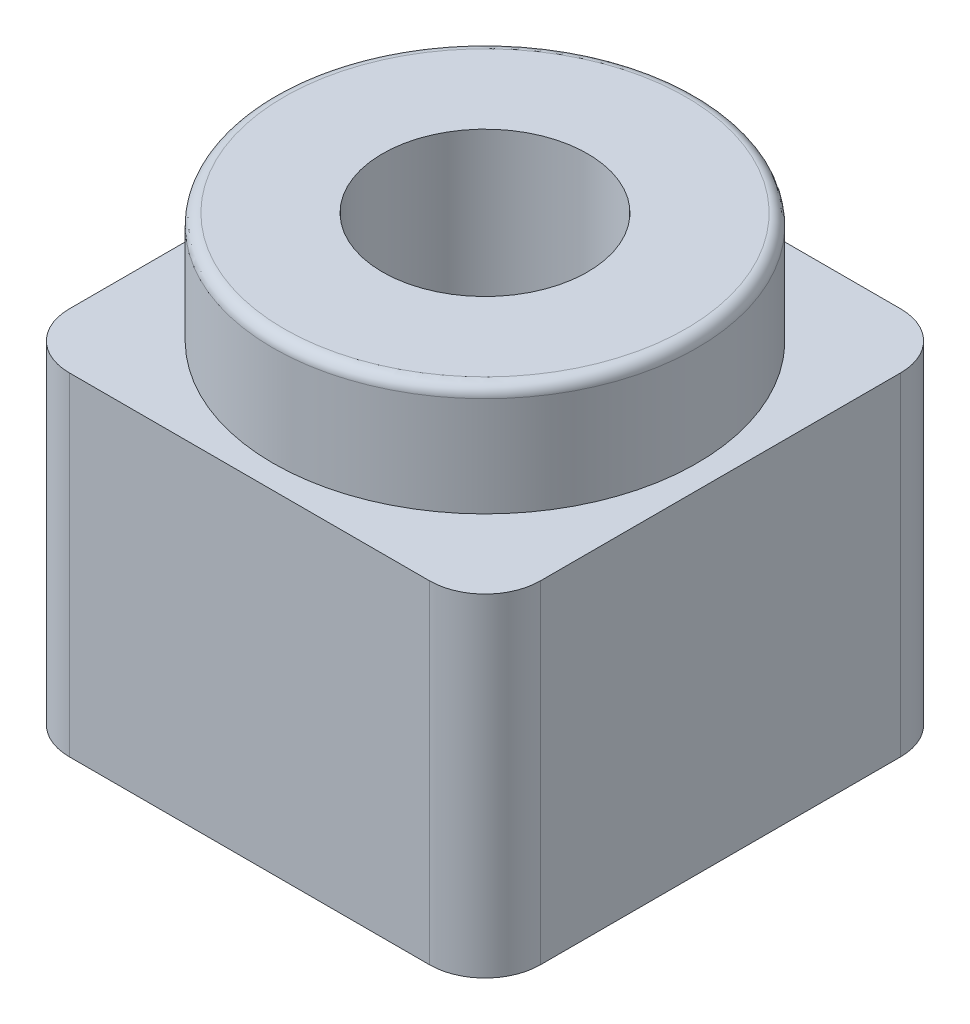
ISO-10303-21;
HEADER;
FILE_DESCRIPTION(('STEP AP214'),'2;1');
FILE_NAME('part.step','',(''),(''),'','','');
FILE_SCHEMA(('AUTOMOTIVE_DESIGN { 1 0 10303 214 1 1 1 1 }'));
ENDSEC;
DATA;
#1=APPLICATION_CONTEXT('core data for automotive mechanical design processes');
#2=APPLICATION_PROTOCOL_DEFINITION('international standard','automotive_design',2000,#1);
#3=PRODUCT_CONTEXT('',#1,'mechanical');
#4=PRODUCT('Part','Part','',(#3));
#5=PRODUCT_RELATED_PRODUCT_CATEGORY('part','',(#4));
#6=PRODUCT_DEFINITION_FORMATION('','',#4);
#7=PRODUCT_DEFINITION_CONTEXT('part definition',#1,'design');
#8=PRODUCT_DEFINITION('design','',#6,#7);
#9=PRODUCT_DEFINITION_SHAPE('','',#8);
#10=(LENGTH_UNIT() NAMED_UNIT(*) SI_UNIT(.MILLI.,.METRE.));
#11=(NAMED_UNIT(*) PLANE_ANGLE_UNIT() SI_UNIT($,.RADIAN.));
#12=(NAMED_UNIT(*) SI_UNIT($,.STERADIAN.) SOLID_ANGLE_UNIT());
#13=UNCERTAINTY_MEASURE_WITH_UNIT(LENGTH_MEASURE(1.E-05),#10,'distance_accuracy_value','');
#14=(GEOMETRIC_REPRESENTATION_CONTEXT(3) GLOBAL_UNCERTAINTY_ASSIGNED_CONTEXT((#13)) GLOBAL_UNIT_ASSIGNED_CONTEXT((#10,
#11,#12)) REPRESENTATION_CONTEXT('',''));
#15=CARTESIAN_POINT('',(0.,0.,0.));
#16=DIRECTION('',(0.,0.,1.));
#17=DIRECTION('',(1.,0.,0.));
#18=AXIS2_PLACEMENT_3D('',#15,#16,#17);
#19=CARTESIAN_POINT('',(0.,6.,0.));
#20=DIRECTION('',(0.,1.,0.));
#21=DIRECTION('',(0.,0.,1.));
#22=AXIS2_PLACEMENT_3D('',#19,#20,#21);
#23=PLANE('',#22);
#24=DIRECTION('',(-1.,0.,0.));
#25=VECTOR('',#24,1.);
#26=CARTESIAN_POINT('',(4.25,6.,-4.25));
#27=LINE('',#26,#25);
#28=CARTESIAN_POINT('',(3.25,6.,-4.25));
#29=VERTEX_POINT('',#28);
#30=CARTESIAN_POINT('',(-3.25,6.,-4.25));
#31=VERTEX_POINT('',#30);
#32=EDGE_CURVE('E112',#29,#31,#27,.T.);
#33=ORIENTED_EDGE('',*,*,#32,.T.);
#34=CARTESIAN_POINT('',(-3.25,6.,-3.25));
#35=DIRECTION('',(0.,1.,0.));
#36=DIRECTION('',(0.,0.,1.));
#37=AXIS2_PLACEMENT_3D('',#34,#35,#36);
#38=CIRCLE('',#37,1.);
#39=CARTESIAN_POINT('',(-4.25,6.,-3.25));
#40=VERTEX_POINT('',#39);
#41=EDGE_CURVE('E157',#31,#40,#38,.T.);
#42=ORIENTED_EDGE('',*,*,#41,.T.);
#43=DIRECTION('',(0.,0.,1.));
#44=VECTOR('',#43,1.);
#45=CARTESIAN_POINT('',(-4.25,6.,-4.25));
#46=LINE('',#45,#44);
#47=CARTESIAN_POINT('',(-4.25,6.,3.25));
#48=VERTEX_POINT('',#47);
#49=EDGE_CURVE('E219',#40,#48,#46,.T.);
#50=ORIENTED_EDGE('',*,*,#49,.T.);
#51=CARTESIAN_POINT('',(-3.25,6.,3.25));
#52=DIRECTION('',(0.,1.,0.));
#53=DIRECTION('',(0.,0.,1.));
#54=AXIS2_PLACEMENT_3D('',#51,#52,#53);
#55=CIRCLE('',#54,1.);
#56=CARTESIAN_POINT('',(-3.25,6.,4.25));
#57=VERTEX_POINT('',#56);
#58=EDGE_CURVE('E140',#48,#57,#55,.T.);
#59=ORIENTED_EDGE('',*,*,#58,.T.);
#60=DIRECTION('',(-1.,0.,0.));
#61=VECTOR('',#60,1.);
#62=CARTESIAN_POINT('',(4.25,6.,4.25));
#63=LINE('',#62,#61);
#64=CARTESIAN_POINT('',(3.25,6.,4.25));
#65=VERTEX_POINT('',#64);
#66=EDGE_CURVE('E218',#65,#57,#63,.T.);
#67=ORIENTED_EDGE('',*,*,#66,.F.);
#68=CARTESIAN_POINT('',(3.25,6.,3.25));
#69=DIRECTION('',(0.,1.,0.));
#70=DIRECTION('',(0.,0.,1.));
#71=AXIS2_PLACEMENT_3D('',#68,#69,#70);
#72=CIRCLE('',#71,1.);
#73=CARTESIAN_POINT('',(4.25,6.,3.25));
#74=VERTEX_POINT('',#73);
#75=EDGE_CURVE('E138',#65,#74,#72,.T.);
#76=ORIENTED_EDGE('',*,*,#75,.T.);
#77=DIRECTION('',(0.,0.,1.));
#78=VECTOR('',#77,1.);
#79=CARTESIAN_POINT('',(4.25,6.,-4.25));
#80=LINE('',#79,#78);
#81=CARTESIAN_POINT('',(4.25,6.,-3.25));
#82=VERTEX_POINT('',#81);
#83=EDGE_CURVE('E114',#82,#74,#80,.T.);
#84=ORIENTED_EDGE('',*,*,#83,.F.);
#85=CARTESIAN_POINT('',(3.25,6.,-3.25));
#86=DIRECTION('',(0.,1.,0.));
#87=DIRECTION('',(0.,0.,1.));
#88=AXIS2_PLACEMENT_3D('',#85,#86,#87);
#89=CIRCLE('',#88,1.);
#90=EDGE_CURVE('E142',#82,#29,#89,.T.);
#91=ORIENTED_EDGE('',*,*,#90,.T.);
#92=EDGE_LOOP('',(#33,#42,#50,#59,#67,#76,#84,#91));
#93=FACE_BOUND('',#92,.T.);
#94=CARTESIAN_POINT('',(0.,6.,0.));
#95=DIRECTION('',(0.,1.,0.));
#96=DIRECTION('',(0.,0.,1.));
#97=AXIS2_PLACEMENT_3D('',#94,#95,#96);
#98=CIRCLE('',#97,3.825);
#99=CARTESIAN_POINT('',(0.,6.,3.825));
#100=VERTEX_POINT('',#99);
#101=EDGE_CURVE('E118',#100,#100,#98,.T.);
#102=ORIENTED_EDGE('',*,*,#101,.F.);
#103=EDGE_LOOP('',(#102));
#104=FACE_BOUND('',#103,.T.);
#105=ADVANCED_FACE('F32',(#93,#104),#23,.T.);
#106=CARTESIAN_POINT('',(4.25,6.,-4.25));
#107=DIRECTION('',(0.,0.,1.));
#108=DIRECTION('',(1.,0.,0.));
#109=AXIS2_PLACEMENT_3D('',#106,#107,#108);
#110=PLANE('',#109);
#111=DIRECTION('',(-1.,0.,0.));
#112=VECTOR('',#111,1.);
#113=CARTESIAN_POINT('',(4.25,0.,-4.25));
#114=LINE('',#113,#112);
#115=CARTESIAN_POINT('',(3.25,0.,-4.25));
#116=VERTEX_POINT('',#115);
#117=CARTESIAN_POINT('',(-3.25,0.,-4.25));
#118=VERTEX_POINT('',#117);
#119=EDGE_CURVE('E111',#116,#118,#114,.T.);
#120=ORIENTED_EDGE('',*,*,#119,.T.);
#121=DIRECTION('',(0.,-1.,0.));
#122=VECTOR('',#121,1.);
#123=CARTESIAN_POINT('',(-3.25,6.,-4.25));
#124=LINE('',#123,#122);
#125=EDGE_CURVE('E47',#118,#31,#124,.F.);
#126=ORIENTED_EDGE('',*,*,#125,.T.);
#127=ORIENTED_EDGE('',*,*,#32,.F.);
#128=DIRECTION('',(0.,-1.,0.));
#129=VECTOR('',#128,1.);
#130=CARTESIAN_POINT('',(3.25,0.,-4.25));
#131=LINE('',#130,#129);
#132=EDGE_CURVE('E103',#29,#116,#131,.T.);
#133=ORIENTED_EDGE('',*,*,#132,.T.);
#134=EDGE_LOOP('',(#120,#126,#127,#133));
#135=FACE_BOUND('',#134,.T.);
#136=ADVANCED_FACE('F110',(#135),#110,.F.);
#137=CARTESIAN_POINT('',(-4.25,6.,-4.25));
#138=DIRECTION('',(1.,0.,0.));
#139=DIRECTION('',(0.,0.,-1.));
#140=AXIS2_PLACEMENT_3D('',#137,#138,#139);
#141=PLANE('',#140);
#142=ORIENTED_EDGE('',*,*,#49,.F.);
#143=DIRECTION('',(0.,-1.,0.));
#144=VECTOR('',#143,1.);
#145=CARTESIAN_POINT('',(-4.25,6.,-3.25));
#146=LINE('',#145,#144);
#147=CARTESIAN_POINT('',(-4.25,0.,-3.25));
#148=VERTEX_POINT('',#147);
#149=EDGE_CURVE('E152',#40,#148,#146,.T.);
#150=ORIENTED_EDGE('',*,*,#149,.T.);
#151=DIRECTION('',(0.,0.,1.));
#152=VECTOR('',#151,1.);
#153=CARTESIAN_POINT('',(-4.25,0.,-4.25));
#154=LINE('',#153,#152);
#155=CARTESIAN_POINT('',(-4.25,0.,3.25));
#156=VERTEX_POINT('',#155);
#157=EDGE_CURVE('E117',#148,#156,#154,.T.);
#158=ORIENTED_EDGE('',*,*,#157,.T.);
#159=DIRECTION('',(0.,-1.,0.));
#160=VECTOR('',#159,1.);
#161=CARTESIAN_POINT('',(-4.25,6.,3.25));
#162=LINE('',#161,#160);
#163=EDGE_CURVE('E149',#156,#48,#162,.F.);
#164=ORIENTED_EDGE('',*,*,#163,.T.);
#165=EDGE_LOOP('',(#142,#150,#158,#164));
#166=FACE_BOUND('',#165,.T.);
#167=ADVANCED_FACE('F179',(#166),#141,.F.);
#168=CARTESIAN_POINT('',(4.25,6.,4.25));
#169=DIRECTION('',(0.,0.,1.));
#170=DIRECTION('',(1.,0.,0.));
#171=AXIS2_PLACEMENT_3D('',#168,#169,#170);
#172=PLANE('',#171);
#173=ORIENTED_EDGE('',*,*,#66,.T.);
#174=DIRECTION('',(0.,-1.,0.));
#175=VECTOR('',#174,1.);
#176=CARTESIAN_POINT('',(-3.25,0.,4.25));
#177=LINE('',#176,#175);
#178=CARTESIAN_POINT('',(-3.25,0.,4.25));
#179=VERTEX_POINT('',#178);
#180=EDGE_CURVE('E146',#57,#179,#177,.T.);
#181=ORIENTED_EDGE('',*,*,#180,.T.);
#182=DIRECTION('',(-1.,0.,0.));
#183=VECTOR('',#182,1.);
#184=CARTESIAN_POINT('',(4.25,0.,4.25));
#185=LINE('',#184,#183);
#186=CARTESIAN_POINT('',(3.25,0.,4.25));
#187=VERTEX_POINT('',#186);
#188=EDGE_CURVE('E120',#187,#179,#185,.T.);
#189=ORIENTED_EDGE('',*,*,#188,.F.);
#190=DIRECTION('',(0.,-1.,0.));
#191=VECTOR('',#190,1.);
#192=CARTESIAN_POINT('',(3.25,6.,4.25));
#193=LINE('',#192,#191);
#194=EDGE_CURVE('E144',#187,#65,#193,.F.);
#195=ORIENTED_EDGE('',*,*,#194,.T.);
#196=EDGE_LOOP('',(#173,#181,#189,#195));
#197=FACE_BOUND('',#196,.T.);
#198=ADVANCED_FACE('F192',(#197),#172,.T.);
#199=CARTESIAN_POINT('',(4.25,6.,-4.25));
#200=DIRECTION('',(1.,0.,0.));
#201=DIRECTION('',(0.,0.,-1.));
#202=AXIS2_PLACEMENT_3D('',#199,#200,#201);
#203=PLANE('',#202);
#204=DIRECTION('',(0.,0.,1.));
#205=VECTOR('',#204,1.);
#206=CARTESIAN_POINT('',(4.25,0.,-4.25));
#207=LINE('',#206,#205);
#208=CARTESIAN_POINT('',(4.25,0.,-3.25));
#209=VERTEX_POINT('',#208);
#210=CARTESIAN_POINT('',(4.25,0.,3.25));
#211=VERTEX_POINT('',#210);
#212=EDGE_CURVE('E130',#209,#211,#207,.T.);
#213=ORIENTED_EDGE('',*,*,#212,.F.);
#214=DIRECTION('',(0.,-1.,0.));
#215=VECTOR('',#214,1.);
#216=CARTESIAN_POINT('',(4.25,6.,-3.25));
#217=LINE('',#216,#215);
#218=EDGE_CURVE('E104',#209,#82,#217,.F.);
#219=ORIENTED_EDGE('',*,*,#218,.T.);
#220=ORIENTED_EDGE('',*,*,#83,.T.);
#221=DIRECTION('',(0.,-1.,0.));
#222=VECTOR('',#221,1.);
#223=CARTESIAN_POINT('',(4.25,6.,3.25));
#224=LINE('',#223,#222);
#225=EDGE_CURVE('E107',#74,#211,#224,.T.);
#226=ORIENTED_EDGE('',*,*,#225,.T.);
#227=EDGE_LOOP('',(#213,#219,#220,#226));
#228=FACE_BOUND('',#227,.T.);
#229=ADVANCED_FACE('F188',(#228),#203,.T.);
#230=CARTESIAN_POINT('',(0.,0.,0.));
#231=DIRECTION('',(0.,1.,0.));
#232=DIRECTION('',(0.,0.,1.));
#233=AXIS2_PLACEMENT_3D('',#230,#231,#232);
#234=PLANE('',#233);
#235=CARTESIAN_POINT('',(0.,0.,0.));
#236=DIRECTION('',(0.,1.,0.));
#237=DIRECTION('',(0.,0.,1.));
#238=AXIS2_PLACEMENT_3D('',#235,#236,#237);
#239=CIRCLE('',#238,1.85);
#240=CARTESIAN_POINT('',(0.,0.,1.85));
#241=VERTEX_POINT('',#240);
#242=EDGE_CURVE('E123',#241,#241,#239,.T.);
#243=ORIENTED_EDGE('',*,*,#242,.T.);
#244=EDGE_LOOP('',(#243));
#245=FACE_BOUND('',#244,.T.);
#246=ORIENTED_EDGE('',*,*,#157,.F.);
#247=CARTESIAN_POINT('',(-3.25,0.,-3.25));
#248=DIRECTION('',(0.,1.,0.));
#249=DIRECTION('',(0.,0.,1.));
#250=AXIS2_PLACEMENT_3D('',#247,#248,#249);
#251=CIRCLE('',#250,1.);
#252=EDGE_CURVE('E55',#148,#118,#251,.F.);
#253=ORIENTED_EDGE('',*,*,#252,.T.);
#254=ORIENTED_EDGE('',*,*,#119,.F.);
#255=CARTESIAN_POINT('',(3.25,0.,-3.25));
#256=DIRECTION('',(0.,1.,0.));
#257=DIRECTION('',(0.,0.,1.));
#258=AXIS2_PLACEMENT_3D('',#255,#256,#257);
#259=CIRCLE('',#258,1.);
#260=EDGE_CURVE('E99',#116,#209,#259,.F.);
#261=ORIENTED_EDGE('',*,*,#260,.T.);
#262=ORIENTED_EDGE('',*,*,#212,.T.);
#263=CARTESIAN_POINT('',(3.25,0.,3.25));
#264=DIRECTION('',(0.,1.,0.));
#265=DIRECTION('',(0.,0.,1.));
#266=AXIS2_PLACEMENT_3D('',#263,#264,#265);
#267=CIRCLE('',#266,1.);
#268=EDGE_CURVE('E113',#211,#187,#267,.F.);
#269=ORIENTED_EDGE('',*,*,#268,.T.);
#270=ORIENTED_EDGE('',*,*,#188,.T.);
#271=CARTESIAN_POINT('',(-3.25,0.,3.25));
#272=DIRECTION('',(0.,1.,0.));
#273=DIRECTION('',(0.,0.,1.));
#274=AXIS2_PLACEMENT_3D('',#271,#272,#273);
#275=CIRCLE('',#274,1.);
#276=EDGE_CURVE('E108',#179,#156,#275,.F.);
#277=ORIENTED_EDGE('',*,*,#276,.T.);
#278=EDGE_LOOP('',(#246,#253,#254,#261,#262,#269,#270,#277));
#279=FACE_BOUND('',#278,.T.);
#280=ADVANCED_FACE('F116',(#245,#279),#234,.F.);
#281=CARTESIAN_POINT('',(0.,8.,0.));
#282=DIRECTION('',(0.,-1.,0.));
#283=DIRECTION('',(0.,0.,-1.));
#284=AXIS2_PLACEMENT_3D('',#281,#282,#283);
#285=CYLINDRICAL_SURFACE('',#284,3.825);
#286=CARTESIAN_POINT('',(0.,7.8,0.));
#287=DIRECTION('',(0.,1.,0.));
#288=DIRECTION('',(0.,0.,1.));
#289=AXIS2_PLACEMENT_3D('',#286,#287,#288);
#290=CIRCLE('',#289,3.825);
#291=CARTESIAN_POINT('',(0.,7.8,3.825));
#292=VERTEX_POINT('',#291);
#293=EDGE_CURVE('E11',#292,#292,#290,.F.);
#294=ORIENTED_EDGE('',*,*,#293,.T.);
#295=EDGE_LOOP('',(#294));
#296=FACE_BOUND('',#295,.T.);
#297=ORIENTED_EDGE('',*,*,#101,.T.);
#298=EDGE_LOOP('',(#297));
#299=FACE_BOUND('',#298,.T.);
#300=ADVANCED_FACE('F184',(#296,#299),#285,.T.);
#301=CARTESIAN_POINT('',(0.,8.,0.));
#302=DIRECTION('',(0.,1.,0.));
#303=DIRECTION('',(0.,0.,1.));
#304=AXIS2_PLACEMENT_3D('',#301,#302,#303);
#305=PLANE('',#304);
#306=CARTESIAN_POINT('',(0.,8.,0.));
#307=DIRECTION('',(0.,1.,0.));
#308=DIRECTION('',(0.,0.,1.));
#309=AXIS2_PLACEMENT_3D('',#306,#307,#308);
#310=CIRCLE('',#309,3.625);
#311=CARTESIAN_POINT('',(0.,8.,3.625));
#312=VERTEX_POINT('',#311);
#313=EDGE_CURVE('E40',#312,#312,#310,.T.);
#314=ORIENTED_EDGE('',*,*,#313,.T.);
#315=EDGE_LOOP('',(#314));
#316=FACE_BOUND('',#315,.T.);
#317=CARTESIAN_POINT('',(0.,8.,0.));
#318=DIRECTION('',(0.,1.,0.));
#319=DIRECTION('',(0.,0.,1.));
#320=AXIS2_PLACEMENT_3D('',#317,#318,#319);
#321=CIRCLE('',#320,1.85);
#322=CARTESIAN_POINT('',(0.,8.,1.85));
#323=VERTEX_POINT('',#322);
#324=EDGE_CURVE('E224',#323,#323,#321,.T.);
#325=ORIENTED_EDGE('',*,*,#324,.F.);
#326=EDGE_LOOP('',(#325));
#327=FACE_BOUND('',#326,.T.);
#328=ADVANCED_FACE('F161',(#316,#327),#305,.T.);
#329=CARTESIAN_POINT('',(0.,0.,0.));
#330=DIRECTION('',(0.,1.,0.));
#331=DIRECTION('',(0.,0.,1.));
#332=AXIS2_PLACEMENT_3D('',#329,#330,#331);
#333=CYLINDRICAL_SURFACE('',#332,1.85);
#334=ORIENTED_EDGE('',*,*,#242,.F.);
#335=EDGE_LOOP('',(#334));
#336=FACE_BOUND('',#335,.T.);
#337=ORIENTED_EDGE('',*,*,#324,.T.);
#338=EDGE_LOOP('',(#337));
#339=FACE_BOUND('',#338,.T.);
#340=ADVANCED_FACE('F203',(#336,#339),#333,.F.);
#341=CARTESIAN_POINT('',(3.25,6.,-3.25));
#342=DIRECTION('',(0.,1.,0.));
#343=DIRECTION('',(0.,0.,1.));
#344=AXIS2_PLACEMENT_3D('',#341,#342,#343);
#345=CYLINDRICAL_SURFACE('',#344,1.);
#346=ORIENTED_EDGE('',*,*,#90,.F.);
#347=ORIENTED_EDGE('',*,*,#218,.F.);
#348=ORIENTED_EDGE('',*,*,#260,.F.);
#349=ORIENTED_EDGE('',*,*,#132,.F.);
#350=EDGE_LOOP('',(#346,#347,#348,#349));
#351=FACE_BOUND('',#350,.T.);
#352=ADVANCED_FACE('F102',(#351),#345,.T.);
#353=CARTESIAN_POINT('',(-3.25,6.,3.25));
#354=DIRECTION('',(0.,1.,0.));
#355=DIRECTION('',(0.,0.,1.));
#356=AXIS2_PLACEMENT_3D('',#353,#354,#355);
#357=CYLINDRICAL_SURFACE('',#356,1.);
#358=ORIENTED_EDGE('',*,*,#58,.F.);
#359=ORIENTED_EDGE('',*,*,#163,.F.);
#360=ORIENTED_EDGE('',*,*,#276,.F.);
#361=ORIENTED_EDGE('',*,*,#180,.F.);
#362=EDGE_LOOP('',(#358,#359,#360,#361));
#363=FACE_BOUND('',#362,.T.);
#364=ADVANCED_FACE('F202',(#363),#357,.T.);
#365=CARTESIAN_POINT('',(3.25,6.,3.25));
#366=DIRECTION('',(0.,-1.,0.));
#367=DIRECTION('',(0.,0.,-1.));
#368=AXIS2_PLACEMENT_3D('',#365,#366,#367);
#369=CYLINDRICAL_SURFACE('',#368,1.);
#370=ORIENTED_EDGE('',*,*,#75,.F.);
#371=ORIENTED_EDGE('',*,*,#194,.F.);
#372=ORIENTED_EDGE('',*,*,#268,.F.);
#373=ORIENTED_EDGE('',*,*,#225,.F.);
#374=EDGE_LOOP('',(#370,#371,#372,#373));
#375=FACE_BOUND('',#374,.T.);
#376=ADVANCED_FACE('F170',(#375),#369,.T.);
#377=CARTESIAN_POINT('',(-3.25,6.,-3.25));
#378=DIRECTION('',(0.,-1.,0.));
#379=DIRECTION('',(0.,0.,-1.));
#380=AXIS2_PLACEMENT_3D('',#377,#378,#379);
#381=CYLINDRICAL_SURFACE('',#380,1.);
#382=ORIENTED_EDGE('',*,*,#41,.F.);
#383=ORIENTED_EDGE('',*,*,#125,.F.);
#384=ORIENTED_EDGE('',*,*,#252,.F.);
#385=ORIENTED_EDGE('',*,*,#149,.F.);
#386=EDGE_LOOP('',(#382,#383,#384,#385));
#387=FACE_BOUND('',#386,.T.);
#388=ADVANCED_FACE('F165',(#387),#381,.T.);
#389=CARTESIAN_POINT('',(0.,7.8,0.));
#390=DIRECTION('',(0.,1.,0.));
#391=DIRECTION('',(0.,0.,1.));
#392=AXIS2_PLACEMENT_3D('',#389,#390,#391);
#393=TOROIDAL_SURFACE('',#392,3.625,0.2);
#394=ORIENTED_EDGE('',*,*,#293,.F.);
#395=EDGE_LOOP('',(#394));
#396=FACE_BOUND('',#395,.T.);
#397=ORIENTED_EDGE('',*,*,#313,.F.);
#398=EDGE_LOOP('',(#397));
#399=FACE_BOUND('',#398,.T.);
#400=ADVANCED_FACE('F34',(#396,#399),#393,.T.);
#401=CLOSED_SHELL('',(#105,#136,#167,#198,#229,#280,#300,#328,#340,#352,#364,#376,#388,#400));
#402=MANIFOLD_SOLID_BREP('B2',#401);
#403=ADVANCED_BREP_SHAPE_REPRESENTATION('',(#18,#402),#14);
#404=SHAPE_DEFINITION_REPRESENTATION(#9,#403);
ENDSEC;
END-ISO-10303-21;
